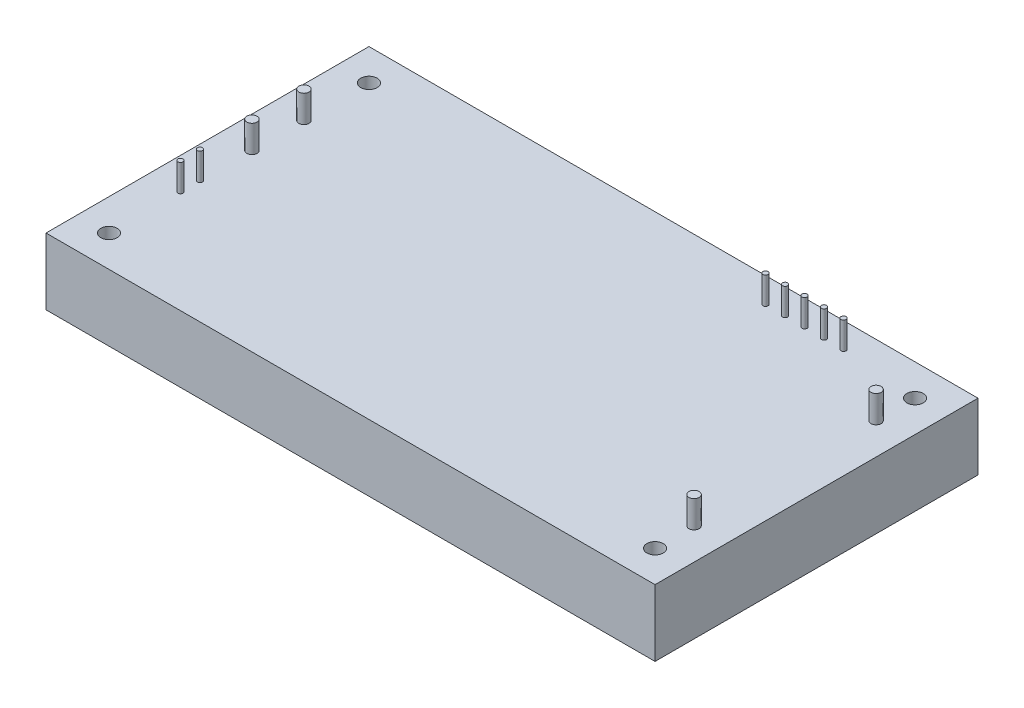
ISO-10303-21;
HEADER;
FILE_DESCRIPTION(('STEP AP214'),'2;1');
FILE_NAME('part.step','',(''),(''),'','','');
FILE_SCHEMA(('AUTOMOTIVE_DESIGN { 1 0 10303 214 1 1 1 1 }'));
ENDSEC;
DATA;
#1=APPLICATION_CONTEXT('core data for automotive mechanical design processes');
#2=APPLICATION_PROTOCOL_DEFINITION('international standard','automotive_design',2000,#1);
#3=PRODUCT_CONTEXT('',#1,'mechanical');
#4=PRODUCT('Part','Part','',(#3));
#5=PRODUCT_RELATED_PRODUCT_CATEGORY('part','',(#4));
#6=PRODUCT_DEFINITION_FORMATION('','',#4);
#7=PRODUCT_DEFINITION_CONTEXT('part definition',#1,'design');
#8=PRODUCT_DEFINITION('design','',#6,#7);
#9=PRODUCT_DEFINITION_SHAPE('','',#8);
#10=(LENGTH_UNIT() NAMED_UNIT(*) SI_UNIT(.MILLI.,.METRE.));
#11=(NAMED_UNIT(*) PLANE_ANGLE_UNIT() SI_UNIT($,.RADIAN.));
#12=(NAMED_UNIT(*) SI_UNIT($,.STERADIAN.) SOLID_ANGLE_UNIT());
#13=UNCERTAINTY_MEASURE_WITH_UNIT(LENGTH_MEASURE(1.E-05),#10,'distance_accuracy_value','');
#14=(GEOMETRIC_REPRESENTATION_CONTEXT(3) GLOBAL_UNCERTAINTY_ASSIGNED_CONTEXT((#13)) GLOBAL_UNIT_ASSIGNED_CONTEXT((#10,
#11,#12)) REPRESENTATION_CONTEXT('',''));
#15=CARTESIAN_POINT('',(0.,0.,0.));
#16=DIRECTION('',(0.,0.,1.));
#17=DIRECTION('',(1.,0.,0.));
#18=AXIS2_PLACEMENT_3D('',#15,#16,#17);
#19=CARTESIAN_POINT('',(59.5,13.,31.55));
#20=DIRECTION('',(-1.,0.,0.));
#21=DIRECTION('',(0.,0.,1.));
#22=AXIS2_PLACEMENT_3D('',#19,#20,#21);
#23=PLANE('',#22);
#24=DIRECTION('',(0.,0.,-1.));
#25=VECTOR('',#24,1.);
#26=CARTESIAN_POINT('',(59.5,0.,31.55));
#27=LINE('',#26,#25);
#28=CARTESIAN_POINT('',(59.5,0.,31.55));
#29=VERTEX_POINT('',#28);
#30=CARTESIAN_POINT('',(59.5,0.,-31.55));
#31=VERTEX_POINT('',#30);
#32=EDGE_CURVE('E102',#29,#31,#27,.T.);
#33=ORIENTED_EDGE('',*,*,#32,.T.);
#34=DIRECTION('',(0.,-1.,0.));
#35=VECTOR('',#34,1.);
#36=CARTESIAN_POINT('',(59.5,13.,-31.55));
#37=LINE('',#36,#35);
#38=CARTESIAN_POINT('',(59.5,13.,-31.55));
#39=VERTEX_POINT('',#38);
#40=EDGE_CURVE('E93',#39,#31,#37,.T.);
#41=ORIENTED_EDGE('',*,*,#40,.F.);
#42=DIRECTION('',(0.,0.,-1.));
#43=VECTOR('',#42,1.);
#44=CARTESIAN_POINT('',(59.5,13.,31.55));
#45=LINE('',#44,#43);
#46=CARTESIAN_POINT('',(59.5,13.,31.55));
#47=VERTEX_POINT('',#46);
#48=EDGE_CURVE('E87',#47,#39,#45,.T.);
#49=ORIENTED_EDGE('',*,*,#48,.F.);
#50=DIRECTION('',(0.,-1.,0.));
#51=VECTOR('',#50,1.);
#52=CARTESIAN_POINT('',(59.5,13.,31.55));
#53=LINE('',#52,#51);
#54=EDGE_CURVE('E98',#47,#29,#53,.T.);
#55=ORIENTED_EDGE('',*,*,#54,.T.);
#56=EDGE_LOOP('',(#33,#41,#49,#55));
#57=FACE_BOUND('',#56,.T.);
#58=ADVANCED_FACE('F35',(#57),#23,.F.);
#59=CARTESIAN_POINT('',(-59.5,13.,-31.55));
#60=DIRECTION('',(0.,0.,1.));
#61=DIRECTION('',(1.,0.,0.));
#62=AXIS2_PLACEMENT_3D('',#59,#60,#61);
#63=PLANE('',#62);
#64=DIRECTION('',(-1.,0.,0.));
#65=VECTOR('',#64,1.);
#66=CARTESIAN_POINT('',(-59.5,0.,-31.55));
#67=LINE('',#66,#65);
#68=CARTESIAN_POINT('',(-59.5,0.,-31.55));
#69=VERTEX_POINT('',#68);
#70=EDGE_CURVE('E92',#31,#69,#67,.T.);
#71=ORIENTED_EDGE('',*,*,#70,.T.);
#72=DIRECTION('',(0.,-1.,0.));
#73=VECTOR('',#72,1.);
#74=CARTESIAN_POINT('',(-59.5,13.,-31.55));
#75=LINE('',#74,#73);
#76=CARTESIAN_POINT('',(-59.5,13.,-31.55));
#77=VERTEX_POINT('',#76);
#78=EDGE_CURVE('E90',#77,#69,#75,.T.);
#79=ORIENTED_EDGE('',*,*,#78,.F.);
#80=DIRECTION('',(-1.,0.,0.));
#81=VECTOR('',#80,1.);
#82=CARTESIAN_POINT('',(-59.5,13.,-31.55));
#83=LINE('',#82,#81);
#84=EDGE_CURVE('E82',#39,#77,#83,.T.);
#85=ORIENTED_EDGE('',*,*,#84,.F.);
#86=ORIENTED_EDGE('',*,*,#40,.T.);
#87=EDGE_LOOP('',(#71,#79,#85,#86));
#88=FACE_BOUND('',#87,.T.);
#89=ADVANCED_FACE('F91',(#88),#63,.F.);
#90=CARTESIAN_POINT('',(-59.5,13.,31.55));
#91=DIRECTION('',(1.,0.,0.));
#92=DIRECTION('',(0.,0.,-1.));
#93=AXIS2_PLACEMENT_3D('',#90,#91,#92);
#94=PLANE('',#93);
#95=DIRECTION('',(0.,0.,1.));
#96=VECTOR('',#95,1.);
#97=CARTESIAN_POINT('',(-59.5,0.,31.55));
#98=LINE('',#97,#96);
#99=CARTESIAN_POINT('',(-59.5,0.,31.55));
#100=VERTEX_POINT('',#99);
#101=EDGE_CURVE('E68',#69,#100,#98,.T.);
#102=ORIENTED_EDGE('',*,*,#101,.T.);
#103=DIRECTION('',(0.,-1.,0.));
#104=VECTOR('',#103,1.);
#105=CARTESIAN_POINT('',(-59.5,13.,31.55));
#106=LINE('',#105,#104);
#107=CARTESIAN_POINT('',(-59.5,13.,31.55));
#108=VERTEX_POINT('',#107);
#109=EDGE_CURVE('E94',#108,#100,#106,.T.);
#110=ORIENTED_EDGE('',*,*,#109,.F.);
#111=DIRECTION('',(0.,0.,1.));
#112=VECTOR('',#111,1.);
#113=CARTESIAN_POINT('',(-59.5,13.,31.55));
#114=LINE('',#113,#112);
#115=EDGE_CURVE('E85',#77,#108,#114,.T.);
#116=ORIENTED_EDGE('',*,*,#115,.F.);
#117=ORIENTED_EDGE('',*,*,#78,.T.);
#118=EDGE_LOOP('',(#102,#110,#116,#117));
#119=FACE_BOUND('',#118,.T.);
#120=ADVANCED_FACE('F96',(#119),#94,.F.);
#121=CARTESIAN_POINT('',(-59.5,13.,31.55));
#122=DIRECTION('',(0.,0.,-1.));
#123=DIRECTION('',(-1.,0.,0.));
#124=AXIS2_PLACEMENT_3D('',#121,#122,#123);
#125=PLANE('',#124);
#126=DIRECTION('',(1.,0.,0.));
#127=VECTOR('',#126,1.);
#128=CARTESIAN_POINT('',(-59.5,0.,31.55));
#129=LINE('',#128,#127);
#130=EDGE_CURVE('E74',#100,#29,#129,.T.);
#131=ORIENTED_EDGE('',*,*,#130,.T.);
#132=ORIENTED_EDGE('',*,*,#54,.F.);
#133=DIRECTION('',(1.,0.,0.));
#134=VECTOR('',#133,1.);
#135=CARTESIAN_POINT('',(-59.5,13.,31.55));
#136=LINE('',#135,#134);
#137=EDGE_CURVE('E51',#108,#47,#136,.T.);
#138=ORIENTED_EDGE('',*,*,#137,.F.);
#139=ORIENTED_EDGE('',*,*,#109,.T.);
#140=EDGE_LOOP('',(#131,#132,#138,#139));
#141=FACE_BOUND('',#140,.T.);
#142=ADVANCED_FACE('F146',(#141),#125,.F.);
#143=CARTESIAN_POINT('',(0.,13.,0.));
#144=DIRECTION('',(0.,-1.,0.));
#145=DIRECTION('',(0.,0.,-1.));
#146=AXIS2_PLACEMENT_3D('',#143,#144,#145);
#147=PLANE('',#146);
#148=CARTESIAN_POINT('',(22.87,13.,-26.67));
#149=DIRECTION('',(0.,-1.,0.));
#150=DIRECTION('',(0.,0.,-1.));
#151=AXIS2_PLACEMENT_3D('',#148,#149,#150);
#152=CIRCLE('',#151,0.499999999999999);
#153=CARTESIAN_POINT('',(22.87,13.,-27.17));
#154=VERTEX_POINT('',#153);
#155=EDGE_CURVE('E11',#154,#154,#152,.F.);
#156=ORIENTED_EDGE('',*,*,#155,.F.);
#157=EDGE_LOOP('',(#156));
#158=FACE_BOUND('',#157,.T.);
#159=CARTESIAN_POINT('',(26.68,13.,-26.67));
#160=DIRECTION('',(0.,-1.,0.));
#161=DIRECTION('',(0.,0.,-1.));
#162=AXIS2_PLACEMENT_3D('',#159,#160,#161);
#163=CIRCLE('',#162,0.499999999999999);
#164=CARTESIAN_POINT('',(26.68,13.,-27.17));
#165=VERTEX_POINT('',#164);
#166=EDGE_CURVE('E43',#165,#165,#163,.F.);
#167=ORIENTED_EDGE('',*,*,#166,.F.);
#168=EDGE_LOOP('',(#167));
#169=FACE_BOUND('',#168,.T.);
#170=CARTESIAN_POINT('',(30.49,13.,-26.67));
#171=DIRECTION('',(0.,-1.,0.));
#172=DIRECTION('',(0.,0.,-1.));
#173=AXIS2_PLACEMENT_3D('',#170,#171,#172);
#174=CIRCLE('',#173,0.499999999999999);
#175=CARTESIAN_POINT('',(30.49,13.,-27.17));
#176=VERTEX_POINT('',#175);
#177=EDGE_CURVE('E136',#176,#176,#174,.F.);
#178=ORIENTED_EDGE('',*,*,#177,.F.);
#179=EDGE_LOOP('',(#178));
#180=FACE_BOUND('',#179,.T.);
#181=CARTESIAN_POINT('',(38.11,13.,-26.67));
#182=DIRECTION('',(0.,-1.,0.));
#183=DIRECTION('',(0.,0.,-1.));
#184=AXIS2_PLACEMENT_3D('',#181,#182,#183);
#185=CIRCLE('',#184,0.499999999999999);
#186=CARTESIAN_POINT('',(38.11,13.,-27.17));
#187=VERTEX_POINT('',#186);
#188=EDGE_CURVE('E133',#187,#187,#185,.F.);
#189=ORIENTED_EDGE('',*,*,#188,.F.);
#190=EDGE_LOOP('',(#189));
#191=FACE_BOUND('',#190,.T.);
#192=CARTESIAN_POINT('',(34.3,13.,-26.67));
#193=DIRECTION('',(0.,-1.,0.));
#194=DIRECTION('',(0.,0.,-1.));
#195=AXIS2_PLACEMENT_3D('',#192,#193,#194);
#196=CIRCLE('',#195,0.499999999999999);
#197=CARTESIAN_POINT('',(34.3,13.,-27.17));
#198=VERTEX_POINT('',#197);
#199=EDGE_CURVE('E130',#198,#198,#196,.F.);
#200=ORIENTED_EDGE('',*,*,#199,.F.);
#201=EDGE_LOOP('',(#200));
#202=FACE_BOUND('',#201,.T.);
#203=CARTESIAN_POINT('',(-53.35,13.,11.43));
#204=DIRECTION('',(0.,-1.,0.));
#205=DIRECTION('',(0.,0.,-1.));
#206=AXIS2_PLACEMENT_3D('',#203,#204,#205);
#207=CIRCLE('',#206,0.499999999999999);
#208=CARTESIAN_POINT('',(-53.35,13.,10.93));
#209=VERTEX_POINT('',#208);
#210=EDGE_CURVE('E127',#209,#209,#207,.F.);
#211=ORIENTED_EDGE('',*,*,#210,.F.);
#212=EDGE_LOOP('',(#211));
#213=FACE_BOUND('',#212,.T.);
#214=CARTESIAN_POINT('',(-53.35,13.,7.62));
#215=DIRECTION('',(0.,-1.,0.));
#216=DIRECTION('',(0.,0.,-1.));
#217=AXIS2_PLACEMENT_3D('',#214,#215,#216);
#218=CIRCLE('',#217,0.499999999999999);
#219=CARTESIAN_POINT('',(-53.35,13.,7.12));
#220=VERTEX_POINT('',#219);
#221=EDGE_CURVE('E124',#220,#220,#218,.F.);
#222=ORIENTED_EDGE('',*,*,#221,.F.);
#223=EDGE_LOOP('',(#222));
#224=FACE_BOUND('',#223,.T.);
#225=CARTESIAN_POINT('',(-53.35,13.,-2.54));
#226=DIRECTION('',(0.,-1.,0.));
#227=DIRECTION('',(0.,0.,-1.));
#228=AXIS2_PLACEMENT_3D('',#225,#226,#227);
#229=CIRCLE('',#228,0.999999999999998);
#230=CARTESIAN_POINT('',(-53.35,13.,-3.54));
#231=VERTEX_POINT('',#230);
#232=EDGE_CURVE('E121',#231,#231,#229,.F.);
#233=ORIENTED_EDGE('',*,*,#232,.F.);
#234=EDGE_LOOP('',(#233));
#235=FACE_BOUND('',#234,.T.);
#236=CARTESIAN_POINT('',(-53.35,13.,-12.7));
#237=DIRECTION('',(0.,-1.,0.));
#238=DIRECTION('',(0.,0.,-1.));
#239=AXIS2_PLACEMENT_3D('',#236,#237,#238);
#240=CIRCLE('',#239,0.999999999999998);
#241=CARTESIAN_POINT('',(-53.35,13.,-13.7));
#242=VERTEX_POINT('',#241);
#243=EDGE_CURVE('E118',#242,#242,#240,.F.);
#244=ORIENTED_EDGE('',*,*,#243,.F.);
#245=EDGE_LOOP('',(#244));
#246=FACE_BOUND('',#245,.T.);
#247=CARTESIAN_POINT('',(53.35,13.,17.78));
#248=DIRECTION('',(0.,-1.,0.));
#249=DIRECTION('',(0.,0.,-1.));
#250=AXIS2_PLACEMENT_3D('',#247,#248,#249);
#251=CIRCLE('',#250,0.999999999999998);
#252=CARTESIAN_POINT('',(53.35,13.,16.78));
#253=VERTEX_POINT('',#252);
#254=EDGE_CURVE('E115',#253,#253,#251,.F.);
#255=ORIENTED_EDGE('',*,*,#254,.F.);
#256=EDGE_LOOP('',(#255));
#257=FACE_BOUND('',#256,.T.);
#258=CARTESIAN_POINT('',(53.35,13.,-17.78));
#259=DIRECTION('',(0.,-1.,0.));
#260=DIRECTION('',(0.,0.,-1.));
#261=AXIS2_PLACEMENT_3D('',#258,#259,#260);
#262=CIRCLE('',#261,0.999999999999998);
#263=CARTESIAN_POINT('',(53.35,13.,-18.78));
#264=VERTEX_POINT('',#263);
#265=EDGE_CURVE('E112',#264,#264,#262,.F.);
#266=ORIENTED_EDGE('',*,*,#265,.F.);
#267=EDGE_LOOP('',(#266));
#268=FACE_BOUND('',#267,.T.);
#269=CARTESIAN_POINT('',(53.35,13.,25.4));
#270=DIRECTION('',(0.,1.,0.));
#271=DIRECTION('',(0.,0.,1.));
#272=AXIS2_PLACEMENT_3D('',#269,#270,#271);
#273=CIRCLE('',#272,1.6);
#274=CARTESIAN_POINT('',(53.35,13.,27.));
#275=VERTEX_POINT('',#274);
#276=EDGE_CURVE('E170',#275,#275,#273,.T.);
#277=ORIENTED_EDGE('',*,*,#276,.F.);
#278=EDGE_LOOP('',(#277));
#279=FACE_BOUND('',#278,.T.);
#280=CARTESIAN_POINT('',(-53.35,13.,-25.4));
#281=DIRECTION('',(0.,1.,0.));
#282=DIRECTION('',(0.,0.,1.));
#283=AXIS2_PLACEMENT_3D('',#280,#281,#282);
#284=CIRCLE('',#283,1.6);
#285=CARTESIAN_POINT('',(-53.35,13.,-23.8));
#286=VERTEX_POINT('',#285);
#287=EDGE_CURVE('E174',#286,#286,#284,.T.);
#288=ORIENTED_EDGE('',*,*,#287,.F.);
#289=EDGE_LOOP('',(#288));
#290=FACE_BOUND('',#289,.T.);
#291=CARTESIAN_POINT('',(-53.35,13.,25.4));
#292=DIRECTION('',(0.,1.,0.));
#293=DIRECTION('',(0.,0.,1.));
#294=AXIS2_PLACEMENT_3D('',#291,#292,#293);
#295=CIRCLE('',#294,1.6);
#296=CARTESIAN_POINT('',(-53.35,13.,27.));
#297=VERTEX_POINT('',#296);
#298=EDGE_CURVE('E178',#297,#297,#295,.T.);
#299=ORIENTED_EDGE('',*,*,#298,.F.);
#300=EDGE_LOOP('',(#299));
#301=FACE_BOUND('',#300,.T.);
#302=CARTESIAN_POINT('',(53.35,13.,-25.4));
#303=DIRECTION('',(0.,1.,0.));
#304=DIRECTION('',(0.,0.,1.));
#305=AXIS2_PLACEMENT_3D('',#302,#303,#304);
#306=CIRCLE('',#305,1.6);
#307=CARTESIAN_POINT('',(53.35,13.,-23.8));
#308=VERTEX_POINT('',#307);
#309=EDGE_CURVE('E181',#308,#308,#306,.T.);
#310=ORIENTED_EDGE('',*,*,#309,.F.);
#311=EDGE_LOOP('',(#310));
#312=FACE_BOUND('',#311,.T.);
#313=ORIENTED_EDGE('',*,*,#48,.T.);
#314=ORIENTED_EDGE('',*,*,#84,.T.);
#315=ORIENTED_EDGE('',*,*,#115,.T.);
#316=ORIENTED_EDGE('',*,*,#137,.T.);
#317=EDGE_LOOP('',(#313,#314,#315,#316));
#318=FACE_BOUND('',#317,.T.);
#319=ADVANCED_FACE('F83',(#158,#169,#180,#191,#202,#213,#224,#235,#246,#257,#268,#279,#290,#301,
#312,#318),#147,.F.);
#320=CARTESIAN_POINT('',(0.,0.,0.));
#321=DIRECTION('',(0.,-1.,0.));
#322=DIRECTION('',(0.,0.,-1.));
#323=AXIS2_PLACEMENT_3D('',#320,#321,#322);
#324=PLANE('',#323);
#325=CARTESIAN_POINT('',(53.35,0.,25.4));
#326=DIRECTION('',(0.,1.,0.));
#327=DIRECTION('',(0.,0.,1.));
#328=AXIS2_PLACEMENT_3D('',#325,#326,#327);
#329=CIRCLE('',#328,1.6);
#330=CARTESIAN_POINT('',(53.35,0.,27.));
#331=VERTEX_POINT('',#330);
#332=EDGE_CURVE('E183',#331,#331,#329,.T.);
#333=ORIENTED_EDGE('',*,*,#332,.T.);
#334=EDGE_LOOP('',(#333));
#335=FACE_BOUND('',#334,.T.);
#336=CARTESIAN_POINT('',(-53.35,0.,-25.4));
#337=DIRECTION('',(0.,1.,0.));
#338=DIRECTION('',(0.,0.,1.));
#339=AXIS2_PLACEMENT_3D('',#336,#337,#338);
#340=CIRCLE('',#339,1.6);
#341=CARTESIAN_POINT('',(-53.35,0.,-23.8));
#342=VERTEX_POINT('',#341);
#343=EDGE_CURVE('E191',#342,#342,#340,.T.);
#344=ORIENTED_EDGE('',*,*,#343,.T.);
#345=EDGE_LOOP('',(#344));
#346=FACE_BOUND('',#345,.T.);
#347=CARTESIAN_POINT('',(-53.35,0.,25.4));
#348=DIRECTION('',(0.,1.,0.));
#349=DIRECTION('',(0.,0.,1.));
#350=AXIS2_PLACEMENT_3D('',#347,#348,#349);
#351=CIRCLE('',#350,1.6);
#352=CARTESIAN_POINT('',(-53.35,0.,27.));
#353=VERTEX_POINT('',#352);
#354=EDGE_CURVE('E192',#353,#353,#351,.T.);
#355=ORIENTED_EDGE('',*,*,#354,.T.);
#356=EDGE_LOOP('',(#355));
#357=FACE_BOUND('',#356,.T.);
#358=CARTESIAN_POINT('',(53.35,0.,-25.4));
#359=DIRECTION('',(0.,1.,0.));
#360=DIRECTION('',(0.,0.,1.));
#361=AXIS2_PLACEMENT_3D('',#358,#359,#360);
#362=CIRCLE('',#361,1.6);
#363=CARTESIAN_POINT('',(53.35,0.,-23.8));
#364=VERTEX_POINT('',#363);
#365=EDGE_CURVE('E105',#364,#364,#362,.T.);
#366=ORIENTED_EDGE('',*,*,#365,.T.);
#367=EDGE_LOOP('',(#366));
#368=FACE_BOUND('',#367,.T.);
#369=ORIENTED_EDGE('',*,*,#32,.F.);
#370=ORIENTED_EDGE('',*,*,#130,.F.);
#371=ORIENTED_EDGE('',*,*,#101,.F.);
#372=ORIENTED_EDGE('',*,*,#70,.F.);
#373=EDGE_LOOP('',(#369,#370,#371,#372));
#374=FACE_BOUND('',#373,.T.);
#375=ADVANCED_FACE('F145',(#335,#346,#357,#368,#374),#324,.T.);
#376=CARTESIAN_POINT('',(53.35,0.,-25.4));
#377=DIRECTION('',(0.,1.,0.));
#378=DIRECTION('',(0.,0.,1.));
#379=AXIS2_PLACEMENT_3D('',#376,#377,#378);
#380=CYLINDRICAL_SURFACE('',#379,1.6);
#381=ORIENTED_EDGE('',*,*,#365,.F.);
#382=EDGE_LOOP('',(#381));
#383=FACE_BOUND('',#382,.T.);
#384=ORIENTED_EDGE('',*,*,#309,.T.);
#385=EDGE_LOOP('',(#384));
#386=FACE_BOUND('',#385,.T.);
#387=ADVANCED_FACE('F256',(#383,#386),#380,.F.);
#388=CARTESIAN_POINT('',(-53.35,0.,25.4));
#389=DIRECTION('',(0.,1.,0.));
#390=DIRECTION('',(0.,0.,1.));
#391=AXIS2_PLACEMENT_3D('',#388,#389,#390);
#392=CYLINDRICAL_SURFACE('',#391,1.6);
#393=ORIENTED_EDGE('',*,*,#354,.F.);
#394=EDGE_LOOP('',(#393));
#395=FACE_BOUND('',#394,.T.);
#396=ORIENTED_EDGE('',*,*,#298,.T.);
#397=EDGE_LOOP('',(#396));
#398=FACE_BOUND('',#397,.T.);
#399=ADVANCED_FACE('F262',(#395,#398),#392,.F.);
#400=CARTESIAN_POINT('',(-53.35,0.,-25.4));
#401=DIRECTION('',(0.,1.,0.));
#402=DIRECTION('',(0.,0.,1.));
#403=AXIS2_PLACEMENT_3D('',#400,#401,#402);
#404=CYLINDRICAL_SURFACE('',#403,1.6);
#405=ORIENTED_EDGE('',*,*,#343,.F.);
#406=EDGE_LOOP('',(#405));
#407=FACE_BOUND('',#406,.T.);
#408=ORIENTED_EDGE('',*,*,#287,.T.);
#409=EDGE_LOOP('',(#408));
#410=FACE_BOUND('',#409,.T.);
#411=ADVANCED_FACE('F453',(#407,#410),#404,.F.);
#412=CARTESIAN_POINT('',(53.35,0.,25.4));
#413=DIRECTION('',(0.,1.,0.));
#414=DIRECTION('',(0.,0.,1.));
#415=AXIS2_PLACEMENT_3D('',#412,#413,#414);
#416=CYLINDRICAL_SURFACE('',#415,1.6);
#417=ORIENTED_EDGE('',*,*,#332,.F.);
#418=EDGE_LOOP('',(#417));
#419=FACE_BOUND('',#418,.T.);
#420=ORIENTED_EDGE('',*,*,#276,.T.);
#421=EDGE_LOOP('',(#420));
#422=FACE_BOUND('',#421,.T.);
#423=ADVANCED_FACE('F449',(#419,#422),#416,.F.);
#424=CARTESIAN_POINT('',(53.35,18.3,-17.78));
#425=DIRECTION('',(0.,-1.,0.));
#426=DIRECTION('',(0.,0.,-1.));
#427=AXIS2_PLACEMENT_3D('',#424,#425,#426);
#428=CYLINDRICAL_SURFACE('',#427,0.999999999999998);
#429=CARTESIAN_POINT('',(53.35,18.3,-17.78));
#430=DIRECTION('',(0.,1.,0.));
#431=DIRECTION('',(0.,0.,1.));
#432=AXIS2_PLACEMENT_3D('',#429,#430,#431);
#433=CIRCLE('',#432,0.999999999999998);
#434=CARTESIAN_POINT('',(53.35,18.3,-16.78));
#435=VERTEX_POINT('',#434);
#436=EDGE_CURVE('E197',#435,#435,#433,.T.);
#437=ORIENTED_EDGE('',*,*,#436,.F.);
#438=EDGE_LOOP('',(#437));
#439=FACE_BOUND('',#438,.T.);
#440=ORIENTED_EDGE('',*,*,#265,.T.);
#441=EDGE_LOOP('',(#440));
#442=FACE_BOUND('',#441,.T.);
#443=ADVANCED_FACE('F445',(#439,#442),#428,.T.);
#444=CARTESIAN_POINT('',(53.35,18.3,-17.78));
#445=DIRECTION('',(0.,1.,0.));
#446=DIRECTION('',(0.,0.,1.));
#447=AXIS2_PLACEMENT_3D('',#444,#445,#446);
#448=PLANE('',#447);
#449=ORIENTED_EDGE('',*,*,#436,.T.);
#450=EDGE_LOOP('',(#449));
#451=FACE_BOUND('',#450,.T.);
#452=ADVANCED_FACE('F441',(#451),#448,.T.);
#453=CARTESIAN_POINT('',(53.35,18.3,17.78));
#454=DIRECTION('',(0.,-1.,0.));
#455=DIRECTION('',(0.,0.,-1.));
#456=AXIS2_PLACEMENT_3D('',#453,#454,#455);
#457=CYLINDRICAL_SURFACE('',#456,0.999999999999998);
#458=CARTESIAN_POINT('',(53.35,18.3,17.78));
#459=DIRECTION('',(0.,1.,0.));
#460=DIRECTION('',(0.,0.,1.));
#461=AXIS2_PLACEMENT_3D('',#458,#459,#460);
#462=CIRCLE('',#461,0.999999999999998);
#463=CARTESIAN_POINT('',(53.35,18.3,18.78));
#464=VERTEX_POINT('',#463);
#465=EDGE_CURVE('E202',#464,#464,#462,.T.);
#466=ORIENTED_EDGE('',*,*,#465,.F.);
#467=EDGE_LOOP('',(#466));
#468=FACE_BOUND('',#467,.T.);
#469=ORIENTED_EDGE('',*,*,#254,.T.);
#470=EDGE_LOOP('',(#469));
#471=FACE_BOUND('',#470,.T.);
#472=ADVANCED_FACE('F437',(#468,#471),#457,.T.);
#473=CARTESIAN_POINT('',(53.35,18.3,17.78));
#474=DIRECTION('',(0.,1.,0.));
#475=DIRECTION('',(0.,0.,1.));
#476=AXIS2_PLACEMENT_3D('',#473,#474,#475);
#477=PLANE('',#476);
#478=ORIENTED_EDGE('',*,*,#465,.T.);
#479=EDGE_LOOP('',(#478));
#480=FACE_BOUND('',#479,.T.);
#481=ADVANCED_FACE('F433',(#480),#477,.T.);
#482=CARTESIAN_POINT('',(-53.35,18.3,-12.7));
#483=DIRECTION('',(0.,-1.,0.));
#484=DIRECTION('',(0.,0.,-1.));
#485=AXIS2_PLACEMENT_3D('',#482,#483,#484);
#486=CYLINDRICAL_SURFACE('',#485,0.999999999999998);
#487=CARTESIAN_POINT('',(-53.35,18.3,-12.7));
#488=DIRECTION('',(0.,1.,0.));
#489=DIRECTION('',(0.,0.,1.));
#490=AXIS2_PLACEMENT_3D('',#487,#488,#489);
#491=CIRCLE('',#490,0.999999999999998);
#492=CARTESIAN_POINT('',(-53.35,18.3,-11.7));
#493=VERTEX_POINT('',#492);
#494=EDGE_CURVE('E205',#493,#493,#491,.T.);
#495=ORIENTED_EDGE('',*,*,#494,.F.);
#496=EDGE_LOOP('',(#495));
#497=FACE_BOUND('',#496,.T.);
#498=ORIENTED_EDGE('',*,*,#243,.T.);
#499=EDGE_LOOP('',(#498));
#500=FACE_BOUND('',#499,.T.);
#501=ADVANCED_FACE('F429',(#497,#500),#486,.T.);
#502=CARTESIAN_POINT('',(-53.35,18.3,-12.7));
#503=DIRECTION('',(0.,1.,0.));
#504=DIRECTION('',(0.,0.,1.));
#505=AXIS2_PLACEMENT_3D('',#502,#503,#504);
#506=PLANE('',#505);
#507=ORIENTED_EDGE('',*,*,#494,.T.);
#508=EDGE_LOOP('',(#507));
#509=FACE_BOUND('',#508,.T.);
#510=ADVANCED_FACE('F425',(#509),#506,.T.);
#511=CARTESIAN_POINT('',(-53.35,18.3,-2.54));
#512=DIRECTION('',(0.,-1.,0.));
#513=DIRECTION('',(0.,0.,-1.));
#514=AXIS2_PLACEMENT_3D('',#511,#512,#513);
#515=CYLINDRICAL_SURFACE('',#514,0.999999999999998);
#516=CARTESIAN_POINT('',(-53.35,18.3,-2.54));
#517=DIRECTION('',(0.,1.,0.));
#518=DIRECTION('',(0.,0.,1.));
#519=AXIS2_PLACEMENT_3D('',#516,#517,#518);
#520=CIRCLE('',#519,0.999999999999998);
#521=CARTESIAN_POINT('',(-53.35,18.3,-1.54));
#522=VERTEX_POINT('',#521);
#523=EDGE_CURVE('E208',#522,#522,#520,.T.);
#524=ORIENTED_EDGE('',*,*,#523,.F.);
#525=EDGE_LOOP('',(#524));
#526=FACE_BOUND('',#525,.T.);
#527=ORIENTED_EDGE('',*,*,#232,.T.);
#528=EDGE_LOOP('',(#527));
#529=FACE_BOUND('',#528,.T.);
#530=ADVANCED_FACE('F421',(#526,#529),#515,.T.);
#531=CARTESIAN_POINT('',(-53.35,18.3,-2.54));
#532=DIRECTION('',(0.,1.,0.));
#533=DIRECTION('',(0.,0.,1.));
#534=AXIS2_PLACEMENT_3D('',#531,#532,#533);
#535=PLANE('',#534);
#536=ORIENTED_EDGE('',*,*,#523,.T.);
#537=EDGE_LOOP('',(#536));
#538=FACE_BOUND('',#537,.T.);
#539=ADVANCED_FACE('F289',(#538),#535,.T.);
#540=CARTESIAN_POINT('',(-53.35,18.3,7.62));
#541=DIRECTION('',(0.,-1.,0.));
#542=DIRECTION('',(0.,0.,-1.));
#543=AXIS2_PLACEMENT_3D('',#540,#541,#542);
#544=CYLINDRICAL_SURFACE('',#543,0.499999999999999);
#545=CARTESIAN_POINT('',(-53.35,18.3,7.62));
#546=DIRECTION('',(0.,1.,0.));
#547=DIRECTION('',(0.,0.,1.));
#548=AXIS2_PLACEMENT_3D('',#545,#546,#547);
#549=CIRCLE('',#548,0.499999999999999);
#550=CARTESIAN_POINT('',(-53.35,18.3,8.12));
#551=VERTEX_POINT('',#550);
#552=EDGE_CURVE('E211',#551,#551,#549,.T.);
#553=ORIENTED_EDGE('',*,*,#552,.F.);
#554=EDGE_LOOP('',(#553));
#555=FACE_BOUND('',#554,.T.);
#556=ORIENTED_EDGE('',*,*,#221,.T.);
#557=EDGE_LOOP('',(#556));
#558=FACE_BOUND('',#557,.T.);
#559=ADVANCED_FACE('F294',(#555,#558),#544,.T.);
#560=CARTESIAN_POINT('',(-53.35,18.3,7.62));
#561=DIRECTION('',(0.,1.,0.));
#562=DIRECTION('',(0.,0.,1.));
#563=AXIS2_PLACEMENT_3D('',#560,#561,#562);
#564=PLANE('',#563);
#565=ORIENTED_EDGE('',*,*,#552,.T.);
#566=EDGE_LOOP('',(#565));
#567=FACE_BOUND('',#566,.T.);
#568=ADVANCED_FACE('F299',(#567),#564,.T.);
#569=CARTESIAN_POINT('',(-53.35,18.3,11.43));
#570=DIRECTION('',(0.,-1.,0.));
#571=DIRECTION('',(0.,0.,-1.));
#572=AXIS2_PLACEMENT_3D('',#569,#570,#571);
#573=CYLINDRICAL_SURFACE('',#572,0.499999999999999);
#574=CARTESIAN_POINT('',(-53.35,18.3,11.43));
#575=DIRECTION('',(0.,1.,0.));
#576=DIRECTION('',(0.,0.,1.));
#577=AXIS2_PLACEMENT_3D('',#574,#575,#576);
#578=CIRCLE('',#577,0.499999999999999);
#579=CARTESIAN_POINT('',(-53.35,18.3,11.93));
#580=VERTEX_POINT('',#579);
#581=EDGE_CURVE('E214',#580,#580,#578,.T.);
#582=ORIENTED_EDGE('',*,*,#581,.F.);
#583=EDGE_LOOP('',(#582));
#584=FACE_BOUND('',#583,.T.);
#585=ORIENTED_EDGE('',*,*,#210,.T.);
#586=EDGE_LOOP('',(#585));
#587=FACE_BOUND('',#586,.T.);
#588=ADVANCED_FACE('F309',(#584,#587),#573,.T.);
#589=CARTESIAN_POINT('',(-53.35,18.3,11.43));
#590=DIRECTION('',(0.,1.,0.));
#591=DIRECTION('',(0.,0.,1.));
#592=AXIS2_PLACEMENT_3D('',#589,#590,#591);
#593=PLANE('',#592);
#594=ORIENTED_EDGE('',*,*,#581,.T.);
#595=EDGE_LOOP('',(#594));
#596=FACE_BOUND('',#595,.T.);
#597=ADVANCED_FACE('F319',(#596),#593,.T.);
#598=CARTESIAN_POINT('',(34.3,18.3,-26.67));
#599=DIRECTION('',(0.,-1.,0.));
#600=DIRECTION('',(0.,0.,-1.));
#601=AXIS2_PLACEMENT_3D('',#598,#599,#600);
#602=CYLINDRICAL_SURFACE('',#601,0.499999999999999);
#603=CARTESIAN_POINT('',(34.3,18.3,-26.67));
#604=DIRECTION('',(0.,1.,0.));
#605=DIRECTION('',(0.,0.,1.));
#606=AXIS2_PLACEMENT_3D('',#603,#604,#605);
#607=CIRCLE('',#606,0.499999999999999);
#608=CARTESIAN_POINT('',(34.3,18.3,-26.17));
#609=VERTEX_POINT('',#608);
#610=EDGE_CURVE('E217',#609,#609,#607,.T.);
#611=ORIENTED_EDGE('',*,*,#610,.F.);
#612=EDGE_LOOP('',(#611));
#613=FACE_BOUND('',#612,.T.);
#614=ORIENTED_EDGE('',*,*,#199,.T.);
#615=EDGE_LOOP('',(#614));
#616=FACE_BOUND('',#615,.T.);
#617=ADVANCED_FACE('F329',(#613,#616),#602,.T.);
#618=CARTESIAN_POINT('',(34.3,18.3,-26.67));
#619=DIRECTION('',(0.,1.,0.));
#620=DIRECTION('',(0.,0.,1.));
#621=AXIS2_PLACEMENT_3D('',#618,#619,#620);
#622=PLANE('',#621);
#623=ORIENTED_EDGE('',*,*,#610,.T.);
#624=EDGE_LOOP('',(#623));
#625=FACE_BOUND('',#624,.T.);
#626=ADVANCED_FACE('F339',(#625),#622,.T.);
#627=CARTESIAN_POINT('',(38.11,18.3,-26.67));
#628=DIRECTION('',(0.,-1.,0.));
#629=DIRECTION('',(0.,0.,-1.));
#630=AXIS2_PLACEMENT_3D('',#627,#628,#629);
#631=CYLINDRICAL_SURFACE('',#630,0.499999999999999);
#632=CARTESIAN_POINT('',(38.11,18.3,-26.67));
#633=DIRECTION('',(0.,1.,0.));
#634=DIRECTION('',(0.,0.,1.));
#635=AXIS2_PLACEMENT_3D('',#632,#633,#634);
#636=CIRCLE('',#635,0.499999999999999);
#637=CARTESIAN_POINT('',(38.11,18.3,-26.17));
#638=VERTEX_POINT('',#637);
#639=EDGE_CURVE('E220',#638,#638,#636,.T.);
#640=ORIENTED_EDGE('',*,*,#639,.F.);
#641=EDGE_LOOP('',(#640));
#642=FACE_BOUND('',#641,.T.);
#643=ORIENTED_EDGE('',*,*,#188,.T.);
#644=EDGE_LOOP('',(#643));
#645=FACE_BOUND('',#644,.T.);
#646=ADVANCED_FACE('F349',(#642,#645),#631,.T.);
#647=CARTESIAN_POINT('',(38.11,18.3,-26.67));
#648=DIRECTION('',(0.,1.,0.));
#649=DIRECTION('',(0.,0.,1.));
#650=AXIS2_PLACEMENT_3D('',#647,#648,#649);
#651=PLANE('',#650);
#652=ORIENTED_EDGE('',*,*,#639,.T.);
#653=EDGE_LOOP('',(#652));
#654=FACE_BOUND('',#653,.T.);
#655=ADVANCED_FACE('F359',(#654),#651,.T.);
#656=CARTESIAN_POINT('',(30.49,18.3,-26.67));
#657=DIRECTION('',(0.,-1.,0.));
#658=DIRECTION('',(0.,0.,-1.));
#659=AXIS2_PLACEMENT_3D('',#656,#657,#658);
#660=CYLINDRICAL_SURFACE('',#659,0.499999999999999);
#661=CARTESIAN_POINT('',(30.49,18.3,-26.67));
#662=DIRECTION('',(0.,1.,0.));
#663=DIRECTION('',(0.,0.,1.));
#664=AXIS2_PLACEMENT_3D('',#661,#662,#663);
#665=CIRCLE('',#664,0.499999999999999);
#666=CARTESIAN_POINT('',(30.49,18.3,-26.17));
#667=VERTEX_POINT('',#666);
#668=EDGE_CURVE('E223',#667,#667,#665,.T.);
#669=ORIENTED_EDGE('',*,*,#668,.F.);
#670=EDGE_LOOP('',(#669));
#671=FACE_BOUND('',#670,.T.);
#672=ORIENTED_EDGE('',*,*,#177,.T.);
#673=EDGE_LOOP('',(#672));
#674=FACE_BOUND('',#673,.T.);
#675=ADVANCED_FACE('F369',(#671,#674),#660,.T.);
#676=CARTESIAN_POINT('',(30.49,18.3,-26.67));
#677=DIRECTION('',(0.,1.,0.));
#678=DIRECTION('',(0.,0.,1.));
#679=AXIS2_PLACEMENT_3D('',#676,#677,#678);
#680=PLANE('',#679);
#681=ORIENTED_EDGE('',*,*,#668,.T.);
#682=EDGE_LOOP('',(#681));
#683=FACE_BOUND('',#682,.T.);
#684=ADVANCED_FACE('F379',(#683),#680,.T.);
#685=CARTESIAN_POINT('',(26.68,18.3,-26.67));
#686=DIRECTION('',(0.,-1.,0.));
#687=DIRECTION('',(0.,0.,-1.));
#688=AXIS2_PLACEMENT_3D('',#685,#686,#687);
#689=CYLINDRICAL_SURFACE('',#688,0.499999999999999);
#690=CARTESIAN_POINT('',(26.68,18.3,-26.67));
#691=DIRECTION('',(0.,1.,0.));
#692=DIRECTION('',(0.,0.,1.));
#693=AXIS2_PLACEMENT_3D('',#690,#691,#692);
#694=CIRCLE('',#693,0.499999999999999);
#695=CARTESIAN_POINT('',(26.68,18.3,-26.17));
#696=VERTEX_POINT('',#695);
#697=EDGE_CURVE('E226',#696,#696,#694,.T.);
#698=ORIENTED_EDGE('',*,*,#697,.F.);
#699=EDGE_LOOP('',(#698));
#700=FACE_BOUND('',#699,.T.);
#701=ORIENTED_EDGE('',*,*,#166,.T.);
#702=EDGE_LOOP('',(#701));
#703=FACE_BOUND('',#702,.T.);
#704=ADVANCED_FACE('F141',(#700,#703),#689,.T.);
#705=CARTESIAN_POINT('',(26.68,18.3,-26.67));
#706=DIRECTION('',(0.,1.,0.));
#707=DIRECTION('',(0.,0.,1.));
#708=AXIS2_PLACEMENT_3D('',#705,#706,#707);
#709=PLANE('',#708);
#710=ORIENTED_EDGE('',*,*,#697,.T.);
#711=EDGE_LOOP('',(#710));
#712=FACE_BOUND('',#711,.T.);
#713=ADVANCED_FACE('F238',(#712),#709,.T.);
#714=CARTESIAN_POINT('',(22.87,18.3,-26.67));
#715=DIRECTION('',(0.,-1.,0.));
#716=DIRECTION('',(0.,0.,-1.));
#717=AXIS2_PLACEMENT_3D('',#714,#715,#716);
#718=CYLINDRICAL_SURFACE('',#717,0.499999999999999);
#719=CARTESIAN_POINT('',(22.87,18.3,-26.67));
#720=DIRECTION('',(0.,1.,0.));
#721=DIRECTION('',(0.,0.,1.));
#722=AXIS2_PLACEMENT_3D('',#719,#720,#721);
#723=CIRCLE('',#722,0.499999999999999);
#724=CARTESIAN_POINT('',(22.87,18.3,-26.17));
#725=VERTEX_POINT('',#724);
#726=EDGE_CURVE('E229',#725,#725,#723,.T.);
#727=ORIENTED_EDGE('',*,*,#726,.F.);
#728=EDGE_LOOP('',(#727));
#729=FACE_BOUND('',#728,.T.);
#730=ORIENTED_EDGE('',*,*,#155,.T.);
#731=EDGE_LOOP('',(#730));
#732=FACE_BOUND('',#731,.T.);
#733=ADVANCED_FACE('F235',(#729,#732),#718,.T.);
#734=CARTESIAN_POINT('',(22.87,18.3,-26.67));
#735=DIRECTION('',(0.,1.,0.));
#736=DIRECTION('',(0.,0.,1.));
#737=AXIS2_PLACEMENT_3D('',#734,#735,#736);
#738=PLANE('',#737);
#739=ORIENTED_EDGE('',*,*,#726,.T.);
#740=EDGE_LOOP('',(#739));
#741=FACE_BOUND('',#740,.T.);
#742=ADVANCED_FACE('F233',(#741),#738,.T.);
#743=CLOSED_SHELL('',(#58,#89,#120,#142,#319,#375,#387,#399,#411,#423,#443,#452,#472,#481,#501,
#510,#530,#539,#559,#568,#588,#597,#617,#626,#646,#655,#675,#684,#704,#713,#733,#742));
#744=MANIFOLD_SOLID_BREP('B2',#743);
#745=ADVANCED_BREP_SHAPE_REPRESENTATION('',(#18,#744),#14);
#746=SHAPE_DEFINITION_REPRESENTATION(#9,#745);
ENDSEC;
END-ISO-10303-21;
